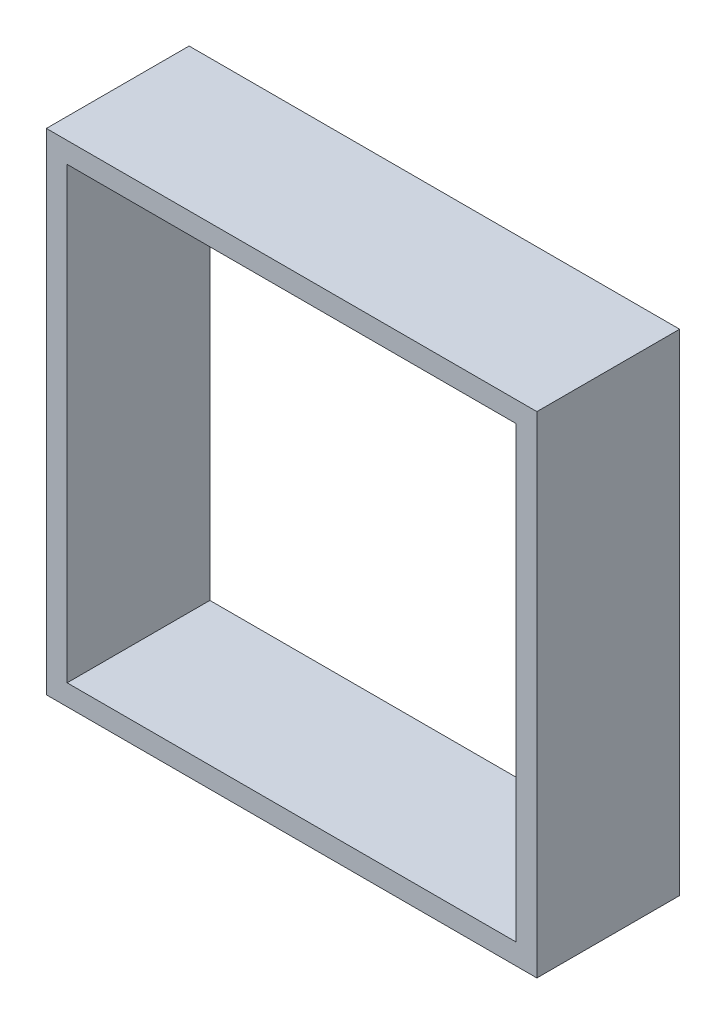
ISO-10303-21;
HEADER;
FILE_DESCRIPTION(('STEP AP214'),'2;1');
FILE_NAME('part.step','',(''),(''),'','','');
FILE_SCHEMA(('AUTOMOTIVE_DESIGN { 1 0 10303 214 1 1 1 1 }'));
ENDSEC;
DATA;
#1=APPLICATION_CONTEXT('core data for automotive mechanical design processes');
#2=APPLICATION_PROTOCOL_DEFINITION('international standard','automotive_design',2000,#1);
#3=PRODUCT_CONTEXT('',#1,'mechanical');
#4=PRODUCT('Part','Part','',(#3));
#5=PRODUCT_RELATED_PRODUCT_CATEGORY('part','',(#4));
#6=PRODUCT_DEFINITION_FORMATION('','',#4);
#7=PRODUCT_DEFINITION_CONTEXT('part definition',#1,'design');
#8=PRODUCT_DEFINITION('design','',#6,#7);
#9=PRODUCT_DEFINITION_SHAPE('','',#8);
#10=(LENGTH_UNIT() NAMED_UNIT(*) SI_UNIT(.MILLI.,.METRE.));
#11=(NAMED_UNIT(*) PLANE_ANGLE_UNIT() SI_UNIT($,.RADIAN.));
#12=(NAMED_UNIT(*) SI_UNIT($,.STERADIAN.) SOLID_ANGLE_UNIT());
#13=UNCERTAINTY_MEASURE_WITH_UNIT(LENGTH_MEASURE(1.E-05),#10,'distance_accuracy_value','');
#14=(GEOMETRIC_REPRESENTATION_CONTEXT(3) GLOBAL_UNCERTAINTY_ASSIGNED_CONTEXT((#13)) GLOBAL_UNIT_ASSIGNED_CONTEXT((#10,
#11,#12)) REPRESENTATION_CONTEXT('',''));
#15=CARTESIAN_POINT('',(0.,0.,0.));
#16=DIRECTION('',(0.,0.,1.));
#17=DIRECTION('',(1.,0.,0.));
#18=AXIS2_PLACEMENT_3D('',#15,#16,#17);
#19=CARTESIAN_POINT('',(0.,0.,5.5));
#20=DIRECTION('',(0.,0.,-1.));
#21=DIRECTION('',(-1.,0.,0.));
#22=AXIS2_PLACEMENT_3D('',#19,#20,#21);
#23=PLANE('',#22);
#24=DIRECTION('',(0.,1.,0.));
#25=VECTOR('',#24,1.);
#26=CARTESIAN_POINT('',(9.45,-9.45,5.5));
#27=LINE('',#26,#25);
#28=CARTESIAN_POINT('',(9.45,-9.45,5.5));
#29=VERTEX_POINT('',#28);
#30=CARTESIAN_POINT('',(9.45,9.45,5.5));
#31=VERTEX_POINT('',#30);
#32=EDGE_CURVE('E144',#29,#31,#27,.T.);
#33=ORIENTED_EDGE('',*,*,#32,.T.);
#34=DIRECTION('',(-1.,0.,0.));
#35=VECTOR('',#34,1.);
#36=CARTESIAN_POINT('',(-9.45,9.45,5.5));
#37=LINE('',#36,#35);
#38=CARTESIAN_POINT('',(-9.45,9.45,5.5));
#39=VERTEX_POINT('',#38);
#40=EDGE_CURVE('E147',#31,#39,#37,.T.);
#41=ORIENTED_EDGE('',*,*,#40,.T.);
#42=DIRECTION('',(0.,-1.,0.));
#43=VECTOR('',#42,1.);
#44=CARTESIAN_POINT('',(-9.45,-9.45,5.5));
#45=LINE('',#44,#43);
#46=CARTESIAN_POINT('',(-9.45,-9.45,5.5));
#47=VERTEX_POINT('',#46);
#48=EDGE_CURVE('E150',#39,#47,#45,.T.);
#49=ORIENTED_EDGE('',*,*,#48,.T.);
#50=DIRECTION('',(1.,0.,0.));
#51=VECTOR('',#50,1.);
#52=CARTESIAN_POINT('',(-9.45,-9.45,5.5));
#53=LINE('',#52,#51);
#54=EDGE_CURVE('E152',#47,#29,#53,.T.);
#55=ORIENTED_EDGE('',*,*,#54,.T.);
#56=EDGE_LOOP('',(#33,#41,#49,#55));
#57=FACE_BOUND('',#56,.T.);
#58=DIRECTION('',(0.,1.,0.));
#59=VECTOR('',#58,1.);
#60=CARTESIAN_POINT('',(8.65,-8.65,5.5));
#61=LINE('',#60,#59);
#62=CARTESIAN_POINT('',(8.65,-8.65,5.5));
#63=VERTEX_POINT('',#62);
#64=CARTESIAN_POINT('',(8.65,8.65,5.5));
#65=VERTEX_POINT('',#64);
#66=EDGE_CURVE('E108',#63,#65,#61,.T.);
#67=ORIENTED_EDGE('',*,*,#66,.F.);
#68=DIRECTION('',(1.,0.,0.));
#69=VECTOR('',#68,1.);
#70=CARTESIAN_POINT('',(-8.65000000000001,-8.65,5.5));
#71=LINE('',#70,#69);
#72=CARTESIAN_POINT('',(-8.65000000000001,-8.65,5.5));
#73=VERTEX_POINT('',#72);
#74=EDGE_CURVE('E130',#73,#63,#71,.T.);
#75=ORIENTED_EDGE('',*,*,#74,.F.);
#76=DIRECTION('',(0.,-1.,0.));
#77=VECTOR('',#76,1.);
#78=CARTESIAN_POINT('',(-8.65000000000001,-8.65,5.5));
#79=LINE('',#78,#77);
#80=CARTESIAN_POINT('',(-8.65000000000001,8.65,5.5));
#81=VERTEX_POINT('',#80);
#82=EDGE_CURVE('E128',#81,#73,#79,.T.);
#83=ORIENTED_EDGE('',*,*,#82,.F.);
#84=DIRECTION('',(-1.,0.,0.));
#85=VECTOR('',#84,1.);
#86=CARTESIAN_POINT('',(-8.65000000000001,8.65,5.5));
#87=LINE('',#86,#85);
#88=EDGE_CURVE('E116',#65,#81,#87,.T.);
#89=ORIENTED_EDGE('',*,*,#88,.F.);
#90=EDGE_LOOP('',(#67,#75,#83,#89));
#91=FACE_BOUND('',#90,.T.);
#92=ADVANCED_FACE('F43',(#57,#91),#23,.F.);
#93=CARTESIAN_POINT('',(0.,0.,0.));
#94=DIRECTION('',(0.,0.,-1.));
#95=DIRECTION('',(-1.,0.,0.));
#96=AXIS2_PLACEMENT_3D('',#93,#94,#95);
#97=PLANE('',#96);
#98=DIRECTION('',(0.,1.,0.));
#99=VECTOR('',#98,1.);
#100=CARTESIAN_POINT('',(9.45,-9.45,0.));
#101=LINE('',#100,#99);
#102=CARTESIAN_POINT('',(9.45,-9.45,0.));
#103=VERTEX_POINT('',#102);
#104=CARTESIAN_POINT('',(9.45,9.45,0.));
#105=VERTEX_POINT('',#104);
#106=EDGE_CURVE('E124',#103,#105,#101,.T.);
#107=ORIENTED_EDGE('',*,*,#106,.F.);
#108=DIRECTION('',(1.,0.,0.));
#109=VECTOR('',#108,1.);
#110=CARTESIAN_POINT('',(-9.45,-9.45,0.));
#111=LINE('',#110,#109);
#112=CARTESIAN_POINT('',(-9.45,-9.45,0.));
#113=VERTEX_POINT('',#112);
#114=EDGE_CURVE('E148',#113,#103,#111,.T.);
#115=ORIENTED_EDGE('',*,*,#114,.F.);
#116=DIRECTION('',(0.,-1.,0.));
#117=VECTOR('',#116,1.);
#118=CARTESIAN_POINT('',(-9.45,-9.45,0.));
#119=LINE('',#118,#117);
#120=CARTESIAN_POINT('',(-9.45,9.45,0.));
#121=VERTEX_POINT('',#120);
#122=EDGE_CURVE('E159',#121,#113,#119,.T.);
#123=ORIENTED_EDGE('',*,*,#122,.F.);
#124=DIRECTION('',(-1.,0.,0.));
#125=VECTOR('',#124,1.);
#126=CARTESIAN_POINT('',(-9.45,9.45,0.));
#127=LINE('',#126,#125);
#128=EDGE_CURVE('E157',#105,#121,#127,.T.);
#129=ORIENTED_EDGE('',*,*,#128,.F.);
#130=EDGE_LOOP('',(#107,#115,#123,#129));
#131=FACE_BOUND('',#130,.T.);
#132=DIRECTION('',(1.,0.,0.));
#133=VECTOR('',#132,1.);
#134=CARTESIAN_POINT('',(-8.65000000000001,-8.65,0.));
#135=LINE('',#134,#133);
#136=CARTESIAN_POINT('',(-8.65000000000001,-8.65,0.));
#137=VERTEX_POINT('',#136);
#138=CARTESIAN_POINT('',(8.65,-8.65,0.));
#139=VERTEX_POINT('',#138);
#140=EDGE_CURVE('E117',#137,#139,#135,.T.);
#141=ORIENTED_EDGE('',*,*,#140,.T.);
#142=DIRECTION('',(0.,1.,0.));
#143=VECTOR('',#142,1.);
#144=CARTESIAN_POINT('',(8.65,-8.65,0.));
#145=LINE('',#144,#143);
#146=CARTESIAN_POINT('',(8.65,8.65,0.));
#147=VERTEX_POINT('',#146);
#148=EDGE_CURVE('E66',#139,#147,#145,.T.);
#149=ORIENTED_EDGE('',*,*,#148,.T.);
#150=DIRECTION('',(-1.,0.,0.));
#151=VECTOR('',#150,1.);
#152=CARTESIAN_POINT('',(-8.65000000000001,8.65,0.));
#153=LINE('',#152,#151);
#154=CARTESIAN_POINT('',(-8.65000000000001,8.65,0.));
#155=VERTEX_POINT('',#154);
#156=EDGE_CURVE('E123',#147,#155,#153,.T.);
#157=ORIENTED_EDGE('',*,*,#156,.T.);
#158=DIRECTION('',(0.,-1.,0.));
#159=VECTOR('',#158,1.);
#160=CARTESIAN_POINT('',(-8.65000000000001,-8.65,0.));
#161=LINE('',#160,#159);
#162=EDGE_CURVE('E136',#155,#137,#161,.T.);
#163=ORIENTED_EDGE('',*,*,#162,.T.);
#164=EDGE_LOOP('',(#141,#149,#157,#163));
#165=FACE_BOUND('',#164,.T.);
#166=ADVANCED_FACE('F177',(#131,#165),#97,.T.);
#167=CARTESIAN_POINT('',(9.45,-9.45,5.5));
#168=DIRECTION('',(-1.,0.,0.));
#169=DIRECTION('',(0.,0.,1.));
#170=AXIS2_PLACEMENT_3D('',#167,#168,#169);
#171=PLANE('',#170);
#172=ORIENTED_EDGE('',*,*,#106,.T.);
#173=DIRECTION('',(0.,0.,-1.));
#174=VECTOR('',#173,1.);
#175=CARTESIAN_POINT('',(9.45,9.45,5.5));
#176=LINE('',#175,#174);
#177=EDGE_CURVE('E11',#31,#105,#176,.T.);
#178=ORIENTED_EDGE('',*,*,#177,.F.);
#179=ORIENTED_EDGE('',*,*,#32,.F.);
#180=DIRECTION('',(0.,0.,-1.));
#181=VECTOR('',#180,1.);
#182=CARTESIAN_POINT('',(9.45,-9.45,5.5));
#183=LINE('',#182,#181);
#184=EDGE_CURVE('E154',#29,#103,#183,.T.);
#185=ORIENTED_EDGE('',*,*,#184,.T.);
#186=EDGE_LOOP('',(#172,#178,#179,#185));
#187=FACE_BOUND('',#186,.T.);
#188=ADVANCED_FACE('F45',(#187),#171,.F.);
#189=CARTESIAN_POINT('',(-9.45,9.45,5.5));
#190=DIRECTION('',(0.,-1.,0.));
#191=DIRECTION('',(0.,0.,-1.));
#192=AXIS2_PLACEMENT_3D('',#189,#190,#191);
#193=PLANE('',#192);
#194=ORIENTED_EDGE('',*,*,#128,.T.);
#195=DIRECTION('',(0.,0.,-1.));
#196=VECTOR('',#195,1.);
#197=CARTESIAN_POINT('',(-9.45,9.45,5.5));
#198=LINE('',#197,#196);
#199=EDGE_CURVE('E51',#39,#121,#198,.T.);
#200=ORIENTED_EDGE('',*,*,#199,.F.);
#201=ORIENTED_EDGE('',*,*,#40,.F.);
#202=ORIENTED_EDGE('',*,*,#177,.T.);
#203=EDGE_LOOP('',(#194,#200,#201,#202));
#204=FACE_BOUND('',#203,.T.);
#205=ADVANCED_FACE('F187',(#204),#193,.F.);
#206=CARTESIAN_POINT('',(-9.45,-9.45,5.5));
#207=DIRECTION('',(1.,0.,0.));
#208=DIRECTION('',(0.,0.,-1.));
#209=AXIS2_PLACEMENT_3D('',#206,#207,#208);
#210=PLANE('',#209);
#211=ORIENTED_EDGE('',*,*,#122,.T.);
#212=DIRECTION('',(0.,0.,-1.));
#213=VECTOR('',#212,1.);
#214=CARTESIAN_POINT('',(-9.45,-9.45,5.5));
#215=LINE('',#214,#213);
#216=EDGE_CURVE('E164',#47,#113,#215,.T.);
#217=ORIENTED_EDGE('',*,*,#216,.F.);
#218=ORIENTED_EDGE('',*,*,#48,.F.);
#219=ORIENTED_EDGE('',*,*,#199,.T.);
#220=EDGE_LOOP('',(#211,#217,#218,#219));
#221=FACE_BOUND('',#220,.T.);
#222=ADVANCED_FACE('F171',(#221),#210,.F.);
#223=CARTESIAN_POINT('',(-9.45,-9.45,5.5));
#224=DIRECTION('',(0.,1.,0.));
#225=DIRECTION('',(0.,0.,1.));
#226=AXIS2_PLACEMENT_3D('',#223,#224,#225);
#227=PLANE('',#226);
#228=ORIENTED_EDGE('',*,*,#114,.T.);
#229=ORIENTED_EDGE('',*,*,#184,.F.);
#230=ORIENTED_EDGE('',*,*,#54,.F.);
#231=ORIENTED_EDGE('',*,*,#216,.T.);
#232=EDGE_LOOP('',(#228,#229,#230,#231));
#233=FACE_BOUND('',#232,.T.);
#234=ADVANCED_FACE('F181',(#233),#227,.F.);
#235=CARTESIAN_POINT('',(8.65,-8.65,5.5));
#236=DIRECTION('',(-1.,0.,0.));
#237=DIRECTION('',(0.,0.,1.));
#238=AXIS2_PLACEMENT_3D('',#235,#236,#237);
#239=PLANE('',#238);
#240=ORIENTED_EDGE('',*,*,#148,.F.);
#241=DIRECTION('',(0.,0.,-1.));
#242=VECTOR('',#241,1.);
#243=CARTESIAN_POINT('',(8.65,-8.65,5.5));
#244=LINE('',#243,#242);
#245=EDGE_CURVE('E112',#63,#139,#244,.T.);
#246=ORIENTED_EDGE('',*,*,#245,.F.);
#247=ORIENTED_EDGE('',*,*,#66,.T.);
#248=DIRECTION('',(0.,0.,-1.));
#249=VECTOR('',#248,1.);
#250=CARTESIAN_POINT('',(8.65,8.65,5.5));
#251=LINE('',#250,#249);
#252=EDGE_CURVE('E111',#65,#147,#251,.T.);
#253=ORIENTED_EDGE('',*,*,#252,.T.);
#254=EDGE_LOOP('',(#240,#246,#247,#253));
#255=FACE_BOUND('',#254,.T.);
#256=ADVANCED_FACE('F110',(#255),#239,.T.);
#257=CARTESIAN_POINT('',(-8.65000000000001,8.65,5.5));
#258=DIRECTION('',(0.,-1.,0.));
#259=DIRECTION('',(0.,0.,-1.));
#260=AXIS2_PLACEMENT_3D('',#257,#258,#259);
#261=PLANE('',#260);
#262=ORIENTED_EDGE('',*,*,#156,.F.);
#263=ORIENTED_EDGE('',*,*,#252,.F.);
#264=ORIENTED_EDGE('',*,*,#88,.T.);
#265=DIRECTION('',(0.,0.,-1.));
#266=VECTOR('',#265,1.);
#267=CARTESIAN_POINT('',(-8.65000000000001,8.65,5.5));
#268=LINE('',#267,#266);
#269=EDGE_CURVE('E125',#81,#155,#268,.T.);
#270=ORIENTED_EDGE('',*,*,#269,.T.);
#271=EDGE_LOOP('',(#262,#263,#264,#270));
#272=FACE_BOUND('',#271,.T.);
#273=ADVANCED_FACE('F120',(#272),#261,.T.);
#274=CARTESIAN_POINT('',(-8.65000000000001,-8.65,5.5));
#275=DIRECTION('',(1.,0.,0.));
#276=DIRECTION('',(0.,0.,-1.));
#277=AXIS2_PLACEMENT_3D('',#274,#275,#276);
#278=PLANE('',#277);
#279=ORIENTED_EDGE('',*,*,#162,.F.);
#280=ORIENTED_EDGE('',*,*,#269,.F.);
#281=ORIENTED_EDGE('',*,*,#82,.T.);
#282=DIRECTION('',(0.,0.,-1.));
#283=VECTOR('',#282,1.);
#284=CARTESIAN_POINT('',(-8.65000000000001,-8.65,5.5));
#285=LINE('',#284,#283);
#286=EDGE_CURVE('E58',#73,#137,#285,.T.);
#287=ORIENTED_EDGE('',*,*,#286,.T.);
#288=EDGE_LOOP('',(#279,#280,#281,#287));
#289=FACE_BOUND('',#288,.T.);
#290=ADVANCED_FACE('F210',(#289),#278,.T.);
#291=CARTESIAN_POINT('',(-8.65000000000001,-8.65,5.5));
#292=DIRECTION('',(0.,1.,0.));
#293=DIRECTION('',(0.,0.,1.));
#294=AXIS2_PLACEMENT_3D('',#291,#292,#293);
#295=PLANE('',#294);
#296=ORIENTED_EDGE('',*,*,#140,.F.);
#297=ORIENTED_EDGE('',*,*,#286,.F.);
#298=ORIENTED_EDGE('',*,*,#74,.T.);
#299=ORIENTED_EDGE('',*,*,#245,.T.);
#300=EDGE_LOOP('',(#296,#297,#298,#299));
#301=FACE_BOUND('',#300,.T.);
#302=ADVANCED_FACE('F214',(#301),#295,.T.);
#303=CLOSED_SHELL('',(#92,#166,#188,#205,#222,#234,#256,#273,#290,#302));
#304=MANIFOLD_SOLID_BREP('B2',#303);
#305=ADVANCED_BREP_SHAPE_REPRESENTATION('',(#18,#304),#14);
#306=SHAPE_DEFINITION_REPRESENTATION(#9,#305);
ENDSEC;
END-ISO-10303-21;
